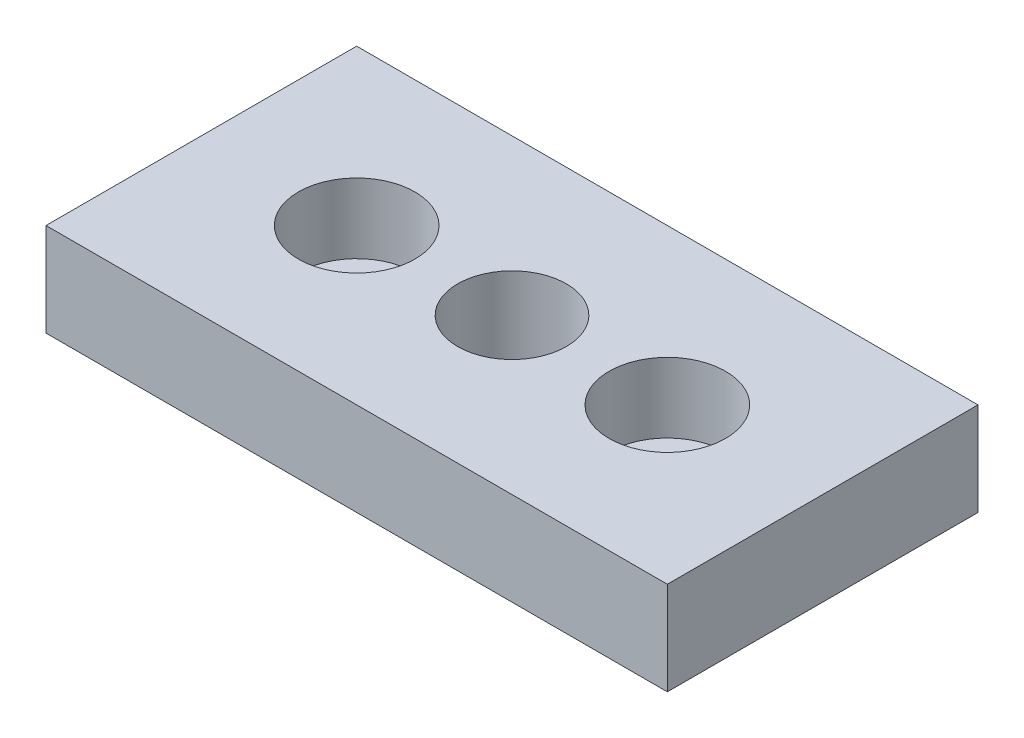
ISO-10303-21;
HEADER;
FILE_DESCRIPTION(('STEP AP214'),'2;1');
FILE_NAME('part.step','',(''),(''),'','','');
FILE_SCHEMA(('AUTOMOTIVE_DESIGN { 1 0 10303 214 1 1 1 1 }'));
ENDSEC;
DATA;
#1=APPLICATION_CONTEXT('core data for automotive mechanical design processes');
#2=APPLICATION_PROTOCOL_DEFINITION('international standard','automotive_design',2000,#1);
#3=PRODUCT_CONTEXT('',#1,'mechanical');
#4=PRODUCT('Part','Part','',(#3));
#5=PRODUCT_RELATED_PRODUCT_CATEGORY('part','',(#4));
#6=PRODUCT_DEFINITION_FORMATION('','',#4);
#7=PRODUCT_DEFINITION_CONTEXT('part definition',#1,'design');
#8=PRODUCT_DEFINITION('design','',#6,#7);
#9=PRODUCT_DEFINITION_SHAPE('','',#8);
#10=(LENGTH_UNIT() NAMED_UNIT(*) SI_UNIT(.MILLI.,.METRE.));
#11=(NAMED_UNIT(*) PLANE_ANGLE_UNIT() SI_UNIT($,.RADIAN.));
#12=(NAMED_UNIT(*) SI_UNIT($,.STERADIAN.) SOLID_ANGLE_UNIT());
#13=UNCERTAINTY_MEASURE_WITH_UNIT(LENGTH_MEASURE(1.E-05),#10,'distance_accuracy_value','');
#14=(GEOMETRIC_REPRESENTATION_CONTEXT(3) GLOBAL_UNCERTAINTY_ASSIGNED_CONTEXT((#13)) GLOBAL_UNIT_ASSIGNED_CONTEXT((#10,
#11,#12)) REPRESENTATION_CONTEXT('',''));
#15=CARTESIAN_POINT('',(0.,0.,0.));
#16=DIRECTION('',(0.,0.,1.));
#17=DIRECTION('',(1.,0.,0.));
#18=AXIS2_PLACEMENT_3D('',#15,#16,#17);
#19=CARTESIAN_POINT('',(40.,12.,20.));
#20=DIRECTION('',(-1.,0.,0.));
#21=DIRECTION('',(0.,0.,1.));
#22=AXIS2_PLACEMENT_3D('',#19,#20,#21);
#23=PLANE('',#22);
#24=DIRECTION('',(0.,0.,-1.));
#25=VECTOR('',#24,1.);
#26=CARTESIAN_POINT('',(40.,0.,20.));
#27=LINE('',#26,#25);
#28=CARTESIAN_POINT('',(40.,0.,20.));
#29=VERTEX_POINT('',#28);
#30=CARTESIAN_POINT('',(40.,0.,-20.));
#31=VERTEX_POINT('',#30);
#32=EDGE_CURVE('E100',#29,#31,#27,.T.);
#33=ORIENTED_EDGE('',*,*,#32,.T.);
#34=DIRECTION('',(0.,-1.,0.));
#35=VECTOR('',#34,1.);
#36=CARTESIAN_POINT('',(40.,12.,-20.));
#37=LINE('',#36,#35);
#38=CARTESIAN_POINT('',(40.,12.,-20.));
#39=VERTEX_POINT('',#38);
#40=EDGE_CURVE('E11',#39,#31,#37,.T.);
#41=ORIENTED_EDGE('',*,*,#40,.F.);
#42=DIRECTION('',(0.,0.,-1.));
#43=VECTOR('',#42,1.);
#44=CARTESIAN_POINT('',(40.,12.,20.));
#45=LINE('',#44,#43);
#46=CARTESIAN_POINT('',(40.,12.,20.));
#47=VERTEX_POINT('',#46);
#48=EDGE_CURVE('E88',#47,#39,#45,.T.);
#49=ORIENTED_EDGE('',*,*,#48,.F.);
#50=DIRECTION('',(0.,-1.,0.));
#51=VECTOR('',#50,1.);
#52=CARTESIAN_POINT('',(40.,12.,20.));
#53=LINE('',#52,#51);
#54=EDGE_CURVE('E96',#47,#29,#53,.T.);
#55=ORIENTED_EDGE('',*,*,#54,.T.);
#56=EDGE_LOOP('',(#33,#41,#49,#55));
#57=FACE_BOUND('',#56,.T.);
#58=ADVANCED_FACE('F37',(#57),#23,.F.);
#59=CARTESIAN_POINT('',(-40.,12.,-20.));
#60=DIRECTION('',(0.,0.,1.));
#61=DIRECTION('',(1.,0.,0.));
#62=AXIS2_PLACEMENT_3D('',#59,#60,#61);
#63=PLANE('',#62);
#64=DIRECTION('',(-1.,0.,0.));
#65=VECTOR('',#64,1.);
#66=CARTESIAN_POINT('',(-40.,0.,-20.));
#67=LINE('',#66,#65);
#68=CARTESIAN_POINT('',(-40.,0.,-20.));
#69=VERTEX_POINT('',#68);
#70=EDGE_CURVE('E92',#31,#69,#67,.T.);
#71=ORIENTED_EDGE('',*,*,#70,.T.);
#72=DIRECTION('',(0.,-1.,0.));
#73=VECTOR('',#72,1.);
#74=CARTESIAN_POINT('',(-40.,12.,-20.));
#75=LINE('',#74,#73);
#76=CARTESIAN_POINT('',(-40.,12.,-20.));
#77=VERTEX_POINT('',#76);
#78=EDGE_CURVE('E45',#77,#69,#75,.T.);
#79=ORIENTED_EDGE('',*,*,#78,.F.);
#80=DIRECTION('',(-1.,0.,0.));
#81=VECTOR('',#80,1.);
#82=CARTESIAN_POINT('',(-40.,12.,-20.));
#83=LINE('',#82,#81);
#84=EDGE_CURVE('E83',#39,#77,#83,.T.);
#85=ORIENTED_EDGE('',*,*,#84,.F.);
#86=ORIENTED_EDGE('',*,*,#40,.T.);
#87=EDGE_LOOP('',(#71,#79,#85,#86));
#88=FACE_BOUND('',#87,.T.);
#89=ADVANCED_FACE('F91',(#88),#63,.F.);
#90=CARTESIAN_POINT('',(-40.,12.,20.));
#91=DIRECTION('',(1.,0.,0.));
#92=DIRECTION('',(0.,0.,-1.));
#93=AXIS2_PLACEMENT_3D('',#90,#91,#92);
#94=PLANE('',#93);
#95=DIRECTION('',(0.,0.,1.));
#96=VECTOR('',#95,1.);
#97=CARTESIAN_POINT('',(-40.,0.,20.));
#98=LINE('',#97,#96);
#99=CARTESIAN_POINT('',(-40.,0.,20.));
#100=VERTEX_POINT('',#99);
#101=EDGE_CURVE('E70',#69,#100,#98,.T.);
#102=ORIENTED_EDGE('',*,*,#101,.T.);
#103=DIRECTION('',(0.,-1.,0.));
#104=VECTOR('',#103,1.);
#105=CARTESIAN_POINT('',(-40.,12.,20.));
#106=LINE('',#105,#104);
#107=CARTESIAN_POINT('',(-40.,12.,20.));
#108=VERTEX_POINT('',#107);
#109=EDGE_CURVE('E93',#108,#100,#106,.T.);
#110=ORIENTED_EDGE('',*,*,#109,.F.);
#111=DIRECTION('',(0.,0.,1.));
#112=VECTOR('',#111,1.);
#113=CARTESIAN_POINT('',(-40.,12.,20.));
#114=LINE('',#113,#112);
#115=EDGE_CURVE('E86',#77,#108,#114,.T.);
#116=ORIENTED_EDGE('',*,*,#115,.F.);
#117=ORIENTED_EDGE('',*,*,#78,.T.);
#118=EDGE_LOOP('',(#102,#110,#116,#117));
#119=FACE_BOUND('',#118,.T.);
#120=ADVANCED_FACE('F94',(#119),#94,.F.);
#121=CARTESIAN_POINT('',(-40.,12.,20.));
#122=DIRECTION('',(0.,0.,-1.));
#123=DIRECTION('',(-1.,0.,0.));
#124=AXIS2_PLACEMENT_3D('',#121,#122,#123);
#125=PLANE('',#124);
#126=DIRECTION('',(1.,0.,0.));
#127=VECTOR('',#126,1.);
#128=CARTESIAN_POINT('',(-40.,0.,20.));
#129=LINE('',#128,#127);
#130=EDGE_CURVE('E76',#100,#29,#129,.T.);
#131=ORIENTED_EDGE('',*,*,#130,.T.);
#132=ORIENTED_EDGE('',*,*,#54,.F.);
#133=DIRECTION('',(1.,0.,0.));
#134=VECTOR('',#133,1.);
#135=CARTESIAN_POINT('',(-40.,12.,20.));
#136=LINE('',#135,#134);
#137=EDGE_CURVE('E53',#108,#47,#136,.T.);
#138=ORIENTED_EDGE('',*,*,#137,.F.);
#139=ORIENTED_EDGE('',*,*,#109,.T.);
#140=EDGE_LOOP('',(#131,#132,#138,#139));
#141=FACE_BOUND('',#140,.T.);
#142=ADVANCED_FACE('F108',(#141),#125,.F.);
#143=CARTESIAN_POINT('',(0.,12.,0.));
#144=DIRECTION('',(0.,-1.,0.));
#145=DIRECTION('',(0.,0.,-1.));
#146=AXIS2_PLACEMENT_3D('',#143,#144,#145);
#147=PLANE('',#146);
#148=CARTESIAN_POINT('',(0.,12.,0.));
#149=DIRECTION('',(0.,1.,0.));
#150=DIRECTION('',(0.,0.,1.));
#151=AXIS2_PLACEMENT_3D('',#148,#149,#150);
#152=CIRCLE('',#151,7.);
#153=CARTESIAN_POINT('',(0.,12.,7.));
#154=VERTEX_POINT('',#153);
#155=EDGE_CURVE('E140',#154,#154,#152,.T.);
#156=ORIENTED_EDGE('',*,*,#155,.F.);
#157=EDGE_LOOP('',(#156));
#158=FACE_BOUND('',#157,.T.);
#159=CARTESIAN_POINT('',(20.,12.,0.));
#160=DIRECTION('',(0.,-1.,0.));
#161=DIRECTION('',(1.,0.,0.));
#162=AXIS2_PLACEMENT_3D('',#159,#160,#161);
#163=CIRCLE('',#162,7.5);
#164=CARTESIAN_POINT('',(27.5,12.,0.));
#165=VERTEX_POINT('',#164);
#166=EDGE_CURVE('E125',#165,#165,#163,.T.);
#167=ORIENTED_EDGE('',*,*,#166,.T.);
#168=EDGE_LOOP('',(#167));
#169=FACE_BOUND('',#168,.T.);
#170=CARTESIAN_POINT('',(-20.,12.,0.));
#171=DIRECTION('',(0.,1.,0.));
#172=DIRECTION('',(-1.,0.,0.));
#173=AXIS2_PLACEMENT_3D('',#170,#171,#172);
#174=CIRCLE('',#173,7.5);
#175=CARTESIAN_POINT('',(-27.5,12.,0.));
#176=VERTEX_POINT('',#175);
#177=EDGE_CURVE('E103',#176,#176,#174,.T.);
#178=ORIENTED_EDGE('',*,*,#177,.F.);
#179=EDGE_LOOP('',(#178));
#180=FACE_BOUND('',#179,.T.);
#181=ORIENTED_EDGE('',*,*,#48,.T.);
#182=ORIENTED_EDGE('',*,*,#84,.T.);
#183=ORIENTED_EDGE('',*,*,#115,.T.);
#184=ORIENTED_EDGE('',*,*,#137,.T.);
#185=EDGE_LOOP('',(#181,#182,#183,#184));
#186=FACE_BOUND('',#185,.T.);
#187=ADVANCED_FACE('F84',(#158,#169,#180,#186),#147,.F.);
#188=CARTESIAN_POINT('',(0.,0.,0.));
#189=DIRECTION('',(0.,-1.,0.));
#190=DIRECTION('',(0.,0.,-1.));
#191=AXIS2_PLACEMENT_3D('',#188,#189,#190);
#192=PLANE('',#191);
#193=CARTESIAN_POINT('',(0.,0.,0.));
#194=DIRECTION('',(0.,-1.,0.));
#195=DIRECTION('',(0.,0.,-1.));
#196=AXIS2_PLACEMENT_3D('',#193,#194,#195);
#197=CIRCLE('',#196,7.);
#198=CARTESIAN_POINT('',(0.,0.,-7.));
#199=VERTEX_POINT('',#198);
#200=EDGE_CURVE('E137',#199,#199,#197,.T.);
#201=ORIENTED_EDGE('',*,*,#200,.F.);
#202=EDGE_LOOP('',(#201));
#203=FACE_BOUND('',#202,.T.);
#204=CARTESIAN_POINT('',(20.,0.,0.));
#205=DIRECTION('',(0.,-1.,0.));
#206=DIRECTION('',(1.,0.,0.));
#207=AXIS2_PLACEMENT_3D('',#204,#205,#206);
#208=CIRCLE('',#207,4.5);
#209=CARTESIAN_POINT('',(24.5,0.,0.));
#210=VERTEX_POINT('',#209);
#211=EDGE_CURVE('E134',#210,#210,#208,.T.);
#212=ORIENTED_EDGE('',*,*,#211,.F.);
#213=EDGE_LOOP('',(#212));
#214=FACE_BOUND('',#213,.T.);
#215=CARTESIAN_POINT('',(-20.,0.,0.));
#216=DIRECTION('',(0.,1.,0.));
#217=DIRECTION('',(-1.,0.,0.));
#218=AXIS2_PLACEMENT_3D('',#215,#216,#217);
#219=CIRCLE('',#218,4.5);
#220=CARTESIAN_POINT('',(-24.5,0.,0.));
#221=VERTEX_POINT('',#220);
#222=EDGE_CURVE('E122',#221,#221,#219,.T.);
#223=ORIENTED_EDGE('',*,*,#222,.T.);
#224=EDGE_LOOP('',(#223));
#225=FACE_BOUND('',#224,.T.);
#226=ORIENTED_EDGE('',*,*,#32,.F.);
#227=ORIENTED_EDGE('',*,*,#130,.F.);
#228=ORIENTED_EDGE('',*,*,#101,.F.);
#229=ORIENTED_EDGE('',*,*,#70,.F.);
#230=EDGE_LOOP('',(#226,#227,#228,#229));
#231=FACE_BOUND('',#230,.T.);
#232=ADVANCED_FACE('F111',(#203,#214,#225,#231),#192,.T.);
#233=CARTESIAN_POINT('',(-20.,12.,0.));
#234=DIRECTION('',(0.,1.,0.));
#235=DIRECTION('',(-1.,0.,0.));
#236=AXIS2_PLACEMENT_3D('',#233,#234,#235);
#237=CYLINDRICAL_SURFACE('',#236,7.5);
#238=CARTESIAN_POINT('',(-20.,3.,0.));
#239=DIRECTION('',(0.,1.,0.));
#240=DIRECTION('',(-1.,0.,0.));
#241=AXIS2_PLACEMENT_3D('',#238,#239,#240);
#242=CIRCLE('',#241,7.5);
#243=CARTESIAN_POINT('',(-27.5,3.,0.));
#244=VERTEX_POINT('',#243);
#245=EDGE_CURVE('E116',#244,#244,#242,.T.);
#246=ORIENTED_EDGE('',*,*,#245,.F.);
#247=EDGE_LOOP('',(#246));
#248=FACE_BOUND('',#247,.T.);
#249=ORIENTED_EDGE('',*,*,#177,.T.);
#250=EDGE_LOOP('',(#249));
#251=FACE_BOUND('',#250,.T.);
#252=ADVANCED_FACE('F154',(#248,#251),#237,.F.);
#253=CARTESIAN_POINT('',(-27.5,3.,0.));
#254=DIRECTION('',(0.,-1.,0.));
#255=DIRECTION('',(1.,0.,0.));
#256=AXIS2_PLACEMENT_3D('',#253,#254,#255);
#257=PLANE('',#256);
#258=CARTESIAN_POINT('',(-20.,3.,0.));
#259=DIRECTION('',(0.,1.,0.));
#260=DIRECTION('',(-1.,0.,0.));
#261=AXIS2_PLACEMENT_3D('',#258,#259,#260);
#262=CIRCLE('',#261,4.5);
#263=CARTESIAN_POINT('',(-24.5,3.,0.));
#264=VERTEX_POINT('',#263);
#265=EDGE_CURVE('E119',#264,#264,#262,.T.);
#266=ORIENTED_EDGE('',*,*,#265,.F.);
#267=EDGE_LOOP('',(#266));
#268=FACE_BOUND('',#267,.T.);
#269=ORIENTED_EDGE('',*,*,#245,.T.);
#270=EDGE_LOOP('',(#269));
#271=FACE_BOUND('',#270,.T.);
#272=ADVANCED_FACE('F156',(#268,#271),#257,.F.);
#273=CARTESIAN_POINT('',(-20.,12.,0.));
#274=DIRECTION('',(0.,1.,0.));
#275=DIRECTION('',(-1.,0.,0.));
#276=AXIS2_PLACEMENT_3D('',#273,#274,#275);
#277=CYLINDRICAL_SURFACE('',#276,4.5);
#278=ORIENTED_EDGE('',*,*,#222,.F.);
#279=EDGE_LOOP('',(#278));
#280=FACE_BOUND('',#279,.T.);
#281=ORIENTED_EDGE('',*,*,#265,.T.);
#282=EDGE_LOOP('',(#281));
#283=FACE_BOUND('',#282,.T.);
#284=ADVANCED_FACE('F163',(#280,#283),#277,.F.);
#285=CARTESIAN_POINT('',(20.,12.,0.));
#286=DIRECTION('',(0.,1.,0.));
#287=DIRECTION('',(1.,0.,0.));
#288=AXIS2_PLACEMENT_3D('',#285,#286,#287);
#289=CYLINDRICAL_SURFACE('',#288,7.5);
#290=CARTESIAN_POINT('',(20.,3.,0.));
#291=DIRECTION('',(0.,-1.,0.));
#292=DIRECTION('',(1.,0.,0.));
#293=AXIS2_PLACEMENT_3D('',#290,#291,#292);
#294=CIRCLE('',#293,7.5);
#295=CARTESIAN_POINT('',(27.5,3.,0.));
#296=VERTEX_POINT('',#295);
#297=EDGE_CURVE('E128',#296,#296,#294,.T.);
#298=ORIENTED_EDGE('',*,*,#297,.T.);
#299=EDGE_LOOP('',(#298));
#300=FACE_BOUND('',#299,.T.);
#301=ORIENTED_EDGE('',*,*,#166,.F.);
#302=EDGE_LOOP('',(#301));
#303=FACE_BOUND('',#302,.T.);
#304=ADVANCED_FACE('F219',(#300,#303),#289,.F.);
#305=CARTESIAN_POINT('',(27.5,3.,0.));
#306=DIRECTION('',(0.,-1.,0.));
#307=DIRECTION('',(-1.,0.,0.));
#308=AXIS2_PLACEMENT_3D('',#305,#306,#307);
#309=PLANE('',#308);
#310=CARTESIAN_POINT('',(20.,3.,0.));
#311=DIRECTION('',(0.,-1.,0.));
#312=DIRECTION('',(1.,0.,0.));
#313=AXIS2_PLACEMENT_3D('',#310,#311,#312);
#314=CIRCLE('',#313,4.5);
#315=CARTESIAN_POINT('',(24.5,3.,0.));
#316=VERTEX_POINT('',#315);
#317=EDGE_CURVE('E131',#316,#316,#314,.T.);
#318=ORIENTED_EDGE('',*,*,#317,.T.);
#319=EDGE_LOOP('',(#318));
#320=FACE_BOUND('',#319,.T.);
#321=ORIENTED_EDGE('',*,*,#297,.F.);
#322=EDGE_LOOP('',(#321));
#323=FACE_BOUND('',#322,.T.);
#324=ADVANCED_FACE('F212',(#320,#323),#309,.F.);
#325=CARTESIAN_POINT('',(20.,12.,0.));
#326=DIRECTION('',(0.,1.,0.));
#327=DIRECTION('',(1.,0.,0.));
#328=AXIS2_PLACEMENT_3D('',#325,#326,#327);
#329=CYLINDRICAL_SURFACE('',#328,4.5);
#330=ORIENTED_EDGE('',*,*,#211,.T.);
#331=EDGE_LOOP('',(#330));
#332=FACE_BOUND('',#331,.T.);
#333=ORIENTED_EDGE('',*,*,#317,.F.);
#334=EDGE_LOOP('',(#333));
#335=FACE_BOUND('',#334,.T.);
#336=ADVANCED_FACE('F202',(#332,#335),#329,.F.);
#337=CARTESIAN_POINT('',(0.,12.,0.));
#338=DIRECTION('',(0.,1.,0.));
#339=DIRECTION('',(0.,0.,1.));
#340=AXIS2_PLACEMENT_3D('',#337,#338,#339);
#341=CYLINDRICAL_SURFACE('',#340,7.);
#342=ORIENTED_EDGE('',*,*,#155,.T.);
#343=EDGE_LOOP('',(#342));
#344=FACE_BOUND('',#343,.T.);
#345=ORIENTED_EDGE('',*,*,#200,.T.);
#346=EDGE_LOOP('',(#345));
#347=FACE_BOUND('',#346,.T.);
#348=ADVANCED_FACE('F144',(#344,#347),#341,.F.);
#349=CLOSED_SHELL('',(#58,#89,#120,#142,#187,#232,#252,#272,#284,#304,#324,#336,#348));
#350=MANIFOLD_SOLID_BREP('B2',#349);
#351=ADVANCED_BREP_SHAPE_REPRESENTATION('',(#18,#350),#14);
#352=SHAPE_DEFINITION_REPRESENTATION(#9,#351);
ENDSEC;
END-ISO-10303-21;
